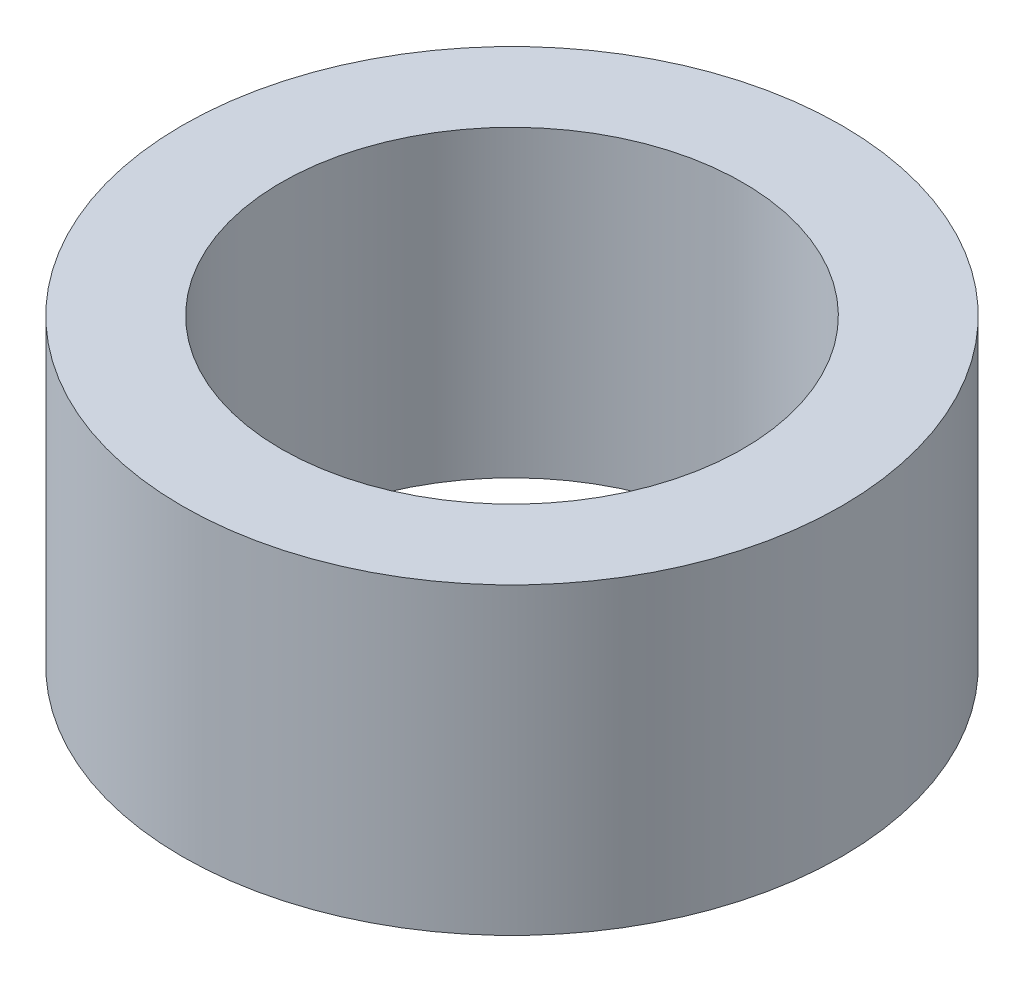
ISO-10303-21;
HEADER;
FILE_DESCRIPTION(('STEP AP214'),'2;1');
FILE_NAME('part.step','',(''),(''),'','','');
FILE_SCHEMA(('AUTOMOTIVE_DESIGN { 1 0 10303 214 1 1 1 1 }'));
ENDSEC;
DATA;
#1=APPLICATION_CONTEXT('core data for automotive mechanical design processes');
#2=APPLICATION_PROTOCOL_DEFINITION('international standard','automotive_design',2000,#1);
#3=PRODUCT_CONTEXT('',#1,'mechanical');
#4=PRODUCT('Part','Part','',(#3));
#5=PRODUCT_RELATED_PRODUCT_CATEGORY('part','',(#4));
#6=PRODUCT_DEFINITION_FORMATION('','',#4);
#7=PRODUCT_DEFINITION_CONTEXT('part definition',#1,'design');
#8=PRODUCT_DEFINITION('design','',#6,#7);
#9=PRODUCT_DEFINITION_SHAPE('','',#8);
#10=(LENGTH_UNIT() NAMED_UNIT(*) SI_UNIT(.MILLI.,.METRE.));
#11=(NAMED_UNIT(*) PLANE_ANGLE_UNIT() SI_UNIT($,.RADIAN.));
#12=(NAMED_UNIT(*) SI_UNIT($,.STERADIAN.) SOLID_ANGLE_UNIT());
#13=UNCERTAINTY_MEASURE_WITH_UNIT(LENGTH_MEASURE(1.E-05),#10,'distance_accuracy_value','');
#14=(GEOMETRIC_REPRESENTATION_CONTEXT(3) GLOBAL_UNCERTAINTY_ASSIGNED_CONTEXT((#13)) GLOBAL_UNIT_ASSIGNED_CONTEXT((#10,
#11,#12)) REPRESENTATION_CONTEXT('',''));
#15=CARTESIAN_POINT('',(0.,0.,0.));
#16=DIRECTION('',(0.,0.,1.));
#17=DIRECTION('',(1.,0.,0.));
#18=AXIS2_PLACEMENT_3D('',#15,#16,#17);
#19=CARTESIAN_POINT('',(16.,-44.,0.));
#20=DIRECTION('',(0.,1.,0.));
#21=DIRECTION('',(-1.,0.,0.));
#22=AXIS2_PLACEMENT_3D('',#19,#20,#21);
#23=PLANE('',#22);
#24=CARTESIAN_POINT('',(2.,-44.,0.));
#25=DIRECTION('',(0.,1.,0.));
#26=DIRECTION('',(0.,0.,1.));
#27=AXIS2_PLACEMENT_3D('',#24,#25,#26);
#28=CIRCLE('',#27,3.5);
#29=CARTESIAN_POINT('',(2.,-44.,3.5));
#30=VERTEX_POINT('',#29);
#31=EDGE_CURVE('E19',#30,#30,#28,.F.);
#32=ORIENTED_EDGE('',*,*,#31,.T.);
#33=EDGE_LOOP('',(#32));
#34=FACE_BOUND('',#33,.T.);
#35=CARTESIAN_POINT('',(2.,-44.,0.));
#36=DIRECTION('',(0.,1.,0.));
#37=DIRECTION('',(0.,0.,1.));
#38=AXIS2_PLACEMENT_3D('',#35,#36,#37);
#39=CIRCLE('',#38,5.);
#40=CARTESIAN_POINT('',(2.,-44.,5.));
#41=VERTEX_POINT('',#40);
#42=EDGE_CURVE('E10',#41,#41,#39,.F.);
#43=ORIENTED_EDGE('',*,*,#42,.F.);
#44=EDGE_LOOP('',(#43));
#45=FACE_BOUND('',#44,.T.);
#46=ADVANCED_FACE('F15',(#34,#45),#23,.T.);
#47=CARTESIAN_POINT('',(2.,-43.998,0.));
#48=DIRECTION('',(0.,-1.,0.));
#49=DIRECTION('',(0.,0.,-1.));
#50=AXIS2_PLACEMENT_3D('',#47,#48,#49);
#51=CYLINDRICAL_SURFACE('',#50,5.);
#52=ORIENTED_EDGE('',*,*,#42,.T.);
#53=EDGE_LOOP('',(#52));
#54=FACE_BOUND('',#53,.T.);
#55=CARTESIAN_POINT('',(2.,-48.604,0.));
#56=DIRECTION('',(0.,1.,0.));
#57=DIRECTION('',(0.,0.,1.));
#58=AXIS2_PLACEMENT_3D('',#55,#56,#57);
#59=CIRCLE('',#58,5.);
#60=CARTESIAN_POINT('',(2.,-48.604,5.));
#61=VERTEX_POINT('',#60);
#62=EDGE_CURVE('E30',#61,#61,#59,.F.);
#63=ORIENTED_EDGE('',*,*,#62,.F.);
#64=EDGE_LOOP('',(#63));
#65=FACE_BOUND('',#64,.T.);
#66=ADVANCED_FACE('F17',(#54,#65),#51,.T.);
#67=CARTESIAN_POINT('',(2.,-43.998,0.));
#68=DIRECTION('',(0.,-1.,0.));
#69=DIRECTION('',(0.,0.,-1.));
#70=AXIS2_PLACEMENT_3D('',#67,#68,#69);
#71=CYLINDRICAL_SURFACE('',#70,3.5);
#72=ORIENTED_EDGE('',*,*,#31,.F.);
#73=EDGE_LOOP('',(#72));
#74=FACE_BOUND('',#73,.T.);
#75=CARTESIAN_POINT('',(2.,-48.604,0.));
#76=DIRECTION('',(0.,1.,0.));
#77=DIRECTION('',(0.,0.,1.));
#78=AXIS2_PLACEMENT_3D('',#75,#76,#77);
#79=CIRCLE('',#78,3.5);
#80=CARTESIAN_POINT('',(2.,-48.604,3.5));
#81=VERTEX_POINT('',#80);
#82=EDGE_CURVE('E32',#81,#81,#79,.F.);
#83=ORIENTED_EDGE('',*,*,#82,.T.);
#84=EDGE_LOOP('',(#83));
#85=FACE_BOUND('',#84,.T.);
#86=ADVANCED_FACE('F45',(#74,#85),#71,.F.);
#87=CARTESIAN_POINT('',(16.,-48.604,0.));
#88=DIRECTION('',(0.,-1.,0.));
#89=DIRECTION('',(-1.,0.,0.));
#90=AXIS2_PLACEMENT_3D('',#87,#88,#89);
#91=PLANE('',#90);
#92=ORIENTED_EDGE('',*,*,#82,.F.);
#93=EDGE_LOOP('',(#92));
#94=FACE_BOUND('',#93,.T.);
#95=ORIENTED_EDGE('',*,*,#62,.T.);
#96=EDGE_LOOP('',(#95));
#97=FACE_BOUND('',#96,.T.);
#98=ADVANCED_FACE('F42',(#94,#97),#91,.T.);
#99=CLOSED_SHELL('',(#46,#66,#86,#98));
#100=MANIFOLD_SOLID_BREP('B1',#99);
#101=ADVANCED_BREP_SHAPE_REPRESENTATION('',(#18,#100),#14);
#102=SHAPE_DEFINITION_REPRESENTATION(#9,#101);
ENDSEC;
END-ISO-10303-21;
